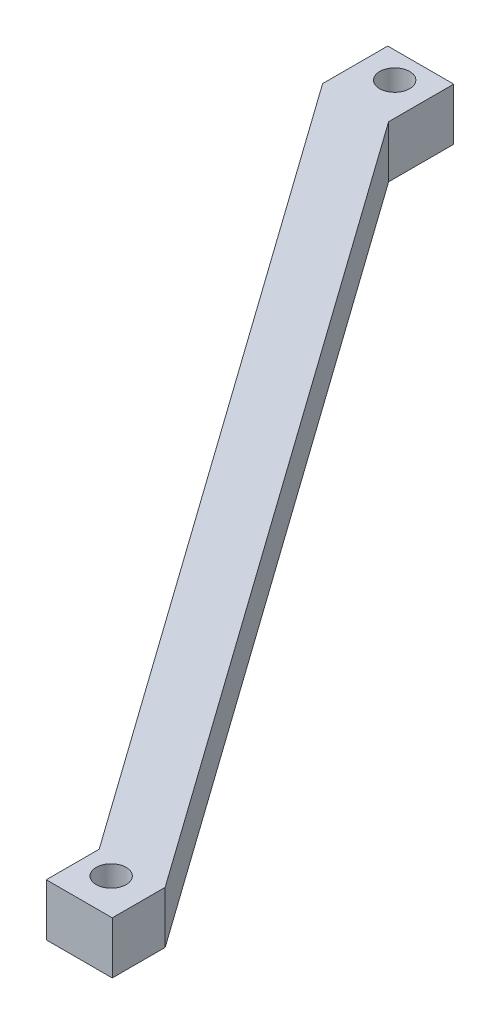
ISO-10303-21;
HEADER;
FILE_DESCRIPTION(('STEP AP214'),'2;1');
FILE_NAME('part.step','',(''),(''),'','','');
FILE_SCHEMA(('AUTOMOTIVE_DESIGN { 1 0 10303 214 1 1 1 1 }'));
ENDSEC;
DATA;
#1=APPLICATION_CONTEXT('core data for automotive mechanical design processes');
#2=APPLICATION_PROTOCOL_DEFINITION('international standard','automotive_design',2000,#1);
#3=PRODUCT_CONTEXT('',#1,'mechanical');
#4=PRODUCT('Part','Part','',(#3));
#5=PRODUCT_RELATED_PRODUCT_CATEGORY('part','',(#4));
#6=PRODUCT_DEFINITION_FORMATION('','',#4);
#7=PRODUCT_DEFINITION_CONTEXT('part definition',#1,'design');
#8=PRODUCT_DEFINITION('design','',#6,#7);
#9=PRODUCT_DEFINITION_SHAPE('','',#8);
#10=(LENGTH_UNIT() NAMED_UNIT(*) SI_UNIT(.MILLI.,.METRE.));
#11=(NAMED_UNIT(*) PLANE_ANGLE_UNIT() SI_UNIT($,.RADIAN.));
#12=(NAMED_UNIT(*) SI_UNIT($,.STERADIAN.) SOLID_ANGLE_UNIT());
#13=UNCERTAINTY_MEASURE_WITH_UNIT(LENGTH_MEASURE(1.E-05),#10,'distance_accuracy_value','');
#14=(GEOMETRIC_REPRESENTATION_CONTEXT(3) GLOBAL_UNCERTAINTY_ASSIGNED_CONTEXT((#13)) GLOBAL_UNIT_ASSIGNED_CONTEXT((#10,
#11,#12)) REPRESENTATION_CONTEXT('',''));
#15=CARTESIAN_POINT('',(0.,0.,0.));
#16=DIRECTION('',(0.,0.,1.));
#17=DIRECTION('',(1.,0.,0.));
#18=AXIS2_PLACEMENT_3D('',#15,#16,#17);
#19=CARTESIAN_POINT('',(12.6661796259949,20.,-10.));
#20=DIRECTION('',(0.,0.,1.));
#21=DIRECTION('',(1.,0.,0.));
#22=AXIS2_PLACEMENT_3D('',#19,#20,#21);
#23=PLANE('',#22);
#24=DIRECTION('',(-1.,0.,0.));
#25=VECTOR('',#24,1.);
#26=CARTESIAN_POINT('',(12.6661796259949,0.,-10.));
#27=LINE('',#26,#25);
#28=CARTESIAN_POINT('',(12.6661796259949,0.,-10.));
#29=VERTEX_POINT('',#28);
#30=CARTESIAN_POINT('',(-12.6661796259949,0.,-10.));
#31=VERTEX_POINT('',#30);
#32=EDGE_CURVE('E142',#29,#31,#27,.T.);
#33=ORIENTED_EDGE('',*,*,#32,.T.);
#34=DIRECTION('',(0.,-1.,0.));
#35=VECTOR('',#34,1.);
#36=CARTESIAN_POINT('',(-12.6661796259949,20.,-10.));
#37=LINE('',#36,#35);
#38=CARTESIAN_POINT('',(-12.6661796259949,20.,-10.));
#39=VERTEX_POINT('',#38);
#40=EDGE_CURVE('E11',#39,#31,#37,.T.);
#41=ORIENTED_EDGE('',*,*,#40,.F.);
#42=DIRECTION('',(-1.,0.,0.));
#43=VECTOR('',#42,1.);
#44=CARTESIAN_POINT('',(12.6661796259949,20.,-10.));
#45=LINE('',#44,#43);
#46=CARTESIAN_POINT('',(12.6661796259949,20.,-10.));
#47=VERTEX_POINT('',#46);
#48=EDGE_CURVE('E165',#47,#39,#45,.T.);
#49=ORIENTED_EDGE('',*,*,#48,.F.);
#50=DIRECTION('',(0.,-1.,0.));
#51=VECTOR('',#50,1.);
#52=CARTESIAN_POINT('',(12.6661796259949,20.,-10.));
#53=LINE('',#52,#51);
#54=EDGE_CURVE('E138',#47,#29,#53,.T.);
#55=ORIENTED_EDGE('',*,*,#54,.T.);
#56=EDGE_LOOP('',(#33,#41,#49,#55));
#57=FACE_BOUND('',#56,.T.);
#58=ADVANCED_FACE('F41',(#57),#23,.F.);
#59=CARTESIAN_POINT('',(-12.6661796259949,20.,-10.));
#60=DIRECTION('',(1.,0.,0.));
#61=DIRECTION('',(0.,0.,-1.));
#62=AXIS2_PLACEMENT_3D('',#59,#60,#61);
#63=PLANE('',#62);
#64=DIRECTION('',(0.,0.,1.));
#65=VECTOR('',#64,1.);
#66=CARTESIAN_POINT('',(-12.6661796259949,0.,-10.));
#67=LINE('',#66,#65);
#68=CARTESIAN_POINT('',(-12.6661796259949,0.,15.));
#69=VERTEX_POINT('',#68);
#70=EDGE_CURVE('E146',#31,#69,#67,.T.);
#71=ORIENTED_EDGE('',*,*,#70,.T.);
#72=DIRECTION('',(0.,-1.,0.));
#73=VECTOR('',#72,1.);
#74=CARTESIAN_POINT('',(-12.6661796259949,20.,15.));
#75=LINE('',#74,#73);
#76=CARTESIAN_POINT('',(-12.6661796259949,20.,15.));
#77=VERTEX_POINT('',#76);
#78=EDGE_CURVE('E50',#77,#69,#75,.T.);
#79=ORIENTED_EDGE('',*,*,#78,.F.);
#80=DIRECTION('',(0.,0.,1.));
#81=VECTOR('',#80,1.);
#82=CARTESIAN_POINT('',(-12.6661796259949,20.,-10.));
#83=LINE('',#82,#81);
#84=EDGE_CURVE('E101',#39,#77,#83,.T.);
#85=ORIENTED_EDGE('',*,*,#84,.F.);
#86=ORIENTED_EDGE('',*,*,#40,.T.);
#87=EDGE_LOOP('',(#71,#79,#85,#86));
#88=FACE_BOUND('',#87,.T.);
#89=ADVANCED_FACE('F249',(#88),#63,.F.);
#90=CARTESIAN_POINT('',(-12.6661796259949,20.,15.));
#91=DIRECTION('',(0.814766107715458,0.,-0.579789780625877));
#92=DIRECTION('',(-0.579789780625877,0.,-0.814766107715458));
#93=AXIS2_PLACEMENT_3D('',#90,#91,#92);
#94=PLANE('',#93);
#95=DIRECTION('',(0.579789780625877,0.,0.814766107715458));
#96=VECTOR('',#95,1.);
#97=CARTESIAN_POINT('',(-12.6661796259949,0.,15.));
#98=LINE('',#97,#96);
#99=CARTESIAN_POINT('',(198.95709030245,0.,312.389629316142));
#100=VERTEX_POINT('',#99);
#101=EDGE_CURVE('E150',#69,#100,#98,.T.);
#102=ORIENTED_EDGE('',*,*,#101,.T.);
#103=DIRECTION('',(0.,-1.,0.));
#104=VECTOR('',#103,1.);
#105=CARTESIAN_POINT('',(198.95709030245,20.,312.389629316142));
#106=LINE('',#105,#104);
#107=CARTESIAN_POINT('',(198.95709030245,20.,312.389629316142));
#108=VERTEX_POINT('',#107);
#109=EDGE_CURVE('E176',#108,#100,#106,.T.);
#110=ORIENTED_EDGE('',*,*,#109,.F.);
#111=DIRECTION('',(0.579789780625877,0.,0.814766107715458));
#112=VECTOR('',#111,1.);
#113=CARTESIAN_POINT('',(-12.6661796259949,20.,15.));
#114=LINE('',#113,#112);
#115=EDGE_CURVE('E186',#77,#108,#114,.T.);
#116=ORIENTED_EDGE('',*,*,#115,.F.);
#117=ORIENTED_EDGE('',*,*,#78,.T.);
#118=EDGE_LOOP('',(#102,#110,#116,#117));
#119=FACE_BOUND('',#118,.T.);
#120=ADVANCED_FACE('F184',(#119),#94,.F.);
#121=CARTESIAN_POINT('',(198.95709030245,20.,312.389629316142));
#122=DIRECTION('',(1.,0.,0.));
#123=DIRECTION('',(0.,0.,-1.));
#124=AXIS2_PLACEMENT_3D('',#121,#122,#123);
#125=PLANE('',#124);
#126=DIRECTION('',(0.,0.,1.));
#127=VECTOR('',#126,1.);
#128=CARTESIAN_POINT('',(198.95709030245,0.,312.389629316142));
#129=LINE('',#128,#127);
#130=CARTESIAN_POINT('',(198.95709030245,0.,332.698194406269));
#131=VERTEX_POINT('',#130);
#132=EDGE_CURVE('E153',#100,#131,#129,.T.);
#133=ORIENTED_EDGE('',*,*,#132,.T.);
#134=DIRECTION('',(0.,-1.,0.));
#135=VECTOR('',#134,1.);
#136=CARTESIAN_POINT('',(198.95709030245,20.,332.698194406269));
#137=LINE('',#136,#135);
#138=CARTESIAN_POINT('',(198.95709030245,20.,332.698194406269));
#139=VERTEX_POINT('',#138);
#140=EDGE_CURVE('E172',#139,#131,#137,.T.);
#141=ORIENTED_EDGE('',*,*,#140,.F.);
#142=DIRECTION('',(0.,0.,1.));
#143=VECTOR('',#142,1.);
#144=CARTESIAN_POINT('',(198.95709030245,20.,312.389629316142));
#145=LINE('',#144,#143);
#146=EDGE_CURVE('E199',#108,#139,#145,.T.);
#147=ORIENTED_EDGE('',*,*,#146,.F.);
#148=ORIENTED_EDGE('',*,*,#109,.T.);
#149=EDGE_LOOP('',(#133,#141,#147,#148));
#150=FACE_BOUND('',#149,.T.);
#151=ADVANCED_FACE('F194',(#150),#125,.F.);
#152=CARTESIAN_POINT('',(198.95709030245,20.,332.698194406269));
#153=DIRECTION('',(0.,0.,-1.));
#154=DIRECTION('',(-1.,0.,0.));
#155=AXIS2_PLACEMENT_3D('',#152,#153,#154);
#156=PLANE('',#155);
#157=DIRECTION('',(1.,0.,0.));
#158=VECTOR('',#157,1.);
#159=CARTESIAN_POINT('',(198.95709030245,0.,332.698194406269));
#160=LINE('',#159,#158);
#161=CARTESIAN_POINT('',(224.28944955444,0.,332.698194406269));
#162=VERTEX_POINT('',#161);
#163=EDGE_CURVE('E156',#131,#162,#160,.T.);
#164=ORIENTED_EDGE('',*,*,#163,.T.);
#165=DIRECTION('',(0.,-1.,0.));
#166=VECTOR('',#165,1.);
#167=CARTESIAN_POINT('',(224.28944955444,20.,332.698194406269));
#168=LINE('',#167,#166);
#169=CARTESIAN_POINT('',(224.28944955444,20.,332.698194406269));
#170=VERTEX_POINT('',#169);
#171=EDGE_CURVE('E131',#170,#162,#168,.T.);
#172=ORIENTED_EDGE('',*,*,#171,.F.);
#173=DIRECTION('',(1.,0.,0.));
#174=VECTOR('',#173,1.);
#175=CARTESIAN_POINT('',(198.95709030245,20.,332.698194406269));
#176=LINE('',#175,#174);
#177=EDGE_CURVE('E120',#139,#170,#176,.T.);
#178=ORIENTED_EDGE('',*,*,#177,.F.);
#179=ORIENTED_EDGE('',*,*,#140,.T.);
#180=EDGE_LOOP('',(#164,#172,#178,#179));
#181=FACE_BOUND('',#180,.T.);
#182=ADVANCED_FACE('F197',(#181),#156,.F.);
#183=CARTESIAN_POINT('',(224.28944955444,20.,332.698194406269));
#184=DIRECTION('',(-1.,0.,0.));
#185=DIRECTION('',(0.,0.,1.));
#186=AXIS2_PLACEMENT_3D('',#183,#184,#185);
#187=PLANE('',#186);
#188=DIRECTION('',(0.,0.,-1.));
#189=VECTOR('',#188,1.);
#190=CARTESIAN_POINT('',(224.28944955444,0.,332.698194406269));
#191=LINE('',#190,#189);
#192=CARTESIAN_POINT('',(224.28944955444,0.,312.389629316142));
#193=VERTEX_POINT('',#192);
#194=EDGE_CURVE('E129',#162,#193,#191,.T.);
#195=ORIENTED_EDGE('',*,*,#194,.T.);
#196=DIRECTION('',(0.,-1.,0.));
#197=VECTOR('',#196,1.);
#198=CARTESIAN_POINT('',(224.28944955444,20.,312.389629316142));
#199=LINE('',#198,#197);
#200=CARTESIAN_POINT('',(224.28944955444,20.,312.389629316142));
#201=VERTEX_POINT('',#200);
#202=EDGE_CURVE('E126',#201,#193,#199,.T.);
#203=ORIENTED_EDGE('',*,*,#202,.F.);
#204=DIRECTION('',(0.,0.,-1.));
#205=VECTOR('',#204,1.);
#206=CARTESIAN_POINT('',(224.28944955444,20.,332.698194406269));
#207=LINE('',#206,#205);
#208=EDGE_CURVE('E114',#170,#201,#207,.T.);
#209=ORIENTED_EDGE('',*,*,#208,.F.);
#210=ORIENTED_EDGE('',*,*,#171,.T.);
#211=EDGE_LOOP('',(#195,#203,#209,#210));
#212=FACE_BOUND('',#211,.T.);
#213=ADVANCED_FACE('F127',(#212),#187,.F.);
#214=CARTESIAN_POINT('',(224.28944955444,20.,312.389629316142));
#215=DIRECTION('',(-0.814766107715458,0.,0.579789780625877));
#216=DIRECTION('',(0.579789780625877,0.,0.814766107715458));
#217=AXIS2_PLACEMENT_3D('',#214,#215,#216);
#218=PLANE('',#217);
#219=DIRECTION('',(-0.579789780625877,0.,-0.814766107715458));
#220=VECTOR('',#219,1.);
#221=CARTESIAN_POINT('',(224.28944955444,0.,312.389629316142));
#222=LINE('',#221,#220);
#223=CARTESIAN_POINT('',(12.6661796259949,0.,15.));
#224=VERTEX_POINT('',#223);
#225=EDGE_CURVE('E87',#193,#224,#222,.T.);
#226=ORIENTED_EDGE('',*,*,#225,.T.);
#227=DIRECTION('',(0.,-1.,0.));
#228=VECTOR('',#227,1.);
#229=CARTESIAN_POINT('',(12.6661796259949,20.,15.));
#230=LINE('',#229,#228);
#231=CARTESIAN_POINT('',(12.6661796259949,20.,15.));
#232=VERTEX_POINT('',#231);
#233=EDGE_CURVE('E132',#232,#224,#230,.T.);
#234=ORIENTED_EDGE('',*,*,#233,.F.);
#235=DIRECTION('',(-0.579789780625877,0.,-0.814766107715458));
#236=VECTOR('',#235,1.);
#237=CARTESIAN_POINT('',(224.28944955444,20.,312.389629316142));
#238=LINE('',#237,#236);
#239=EDGE_CURVE('E118',#201,#232,#238,.T.);
#240=ORIENTED_EDGE('',*,*,#239,.F.);
#241=ORIENTED_EDGE('',*,*,#202,.T.);
#242=EDGE_LOOP('',(#226,#234,#240,#241));
#243=FACE_BOUND('',#242,.T.);
#244=ADVANCED_FACE('F134',(#243),#218,.F.);
#245=CARTESIAN_POINT('',(12.6661796259949,20.,15.));
#246=DIRECTION('',(-1.,0.,0.));
#247=DIRECTION('',(0.,0.,1.));
#248=AXIS2_PLACEMENT_3D('',#245,#246,#247);
#249=PLANE('',#248);
#250=DIRECTION('',(0.,0.,-1.));
#251=VECTOR('',#250,1.);
#252=CARTESIAN_POINT('',(12.6661796259949,0.,15.));
#253=LINE('',#252,#251);
#254=EDGE_CURVE('E93',#224,#29,#253,.T.);
#255=ORIENTED_EDGE('',*,*,#254,.T.);
#256=ORIENTED_EDGE('',*,*,#54,.F.);
#257=DIRECTION('',(0.,0.,-1.));
#258=VECTOR('',#257,1.);
#259=CARTESIAN_POINT('',(12.6661796259949,20.,15.));
#260=LINE('',#259,#258);
#261=EDGE_CURVE('E58',#232,#47,#260,.T.);
#262=ORIENTED_EDGE('',*,*,#261,.F.);
#263=ORIENTED_EDGE('',*,*,#233,.T.);
#264=EDGE_LOOP('',(#255,#256,#262,#263));
#265=FACE_BOUND('',#264,.T.);
#266=ADVANCED_FACE('F236',(#265),#249,.F.);
#267=CARTESIAN_POINT('',(0.,20.,0.));
#268=DIRECTION('',(0.,1.,0.));
#269=DIRECTION('',(0.,0.,1.));
#270=AXIS2_PLACEMENT_3D('',#267,#268,#269);
#271=PLANE('',#270);
#272=CARTESIAN_POINT('',(0.,20.,0.));
#273=DIRECTION('',(0.,1.,0.));
#274=DIRECTION('',(0.,0.,1.));
#275=AXIS2_PLACEMENT_3D('',#272,#273,#274);
#276=CIRCLE('',#275,5.75);
#277=CARTESIAN_POINT('',(0.,20.,5.75));
#278=VERTEX_POINT('',#277);
#279=EDGE_CURVE('E217',#278,#278,#276,.T.);
#280=ORIENTED_EDGE('',*,*,#279,.F.);
#281=EDGE_LOOP('',(#280));
#282=FACE_BOUND('',#281,.T.);
#283=CARTESIAN_POINT('',(210.164682846788,20.,318.990291519835));
#284=DIRECTION('',(0.,1.,0.));
#285=DIRECTION('',(0.,0.,1.));
#286=AXIS2_PLACEMENT_3D('',#283,#284,#285);
#287=CIRCLE('',#286,5.75);
#288=CARTESIAN_POINT('',(210.164682846788,20.,324.740291519835));
#289=VERTEX_POINT('',#288);
#290=EDGE_CURVE('E209',#289,#289,#287,.T.);
#291=ORIENTED_EDGE('',*,*,#290,.F.);
#292=EDGE_LOOP('',(#291));
#293=FACE_BOUND('',#292,.T.);
#294=ORIENTED_EDGE('',*,*,#48,.T.);
#295=ORIENTED_EDGE('',*,*,#84,.T.);
#296=ORIENTED_EDGE('',*,*,#115,.T.);
#297=ORIENTED_EDGE('',*,*,#146,.T.);
#298=ORIENTED_EDGE('',*,*,#177,.T.);
#299=ORIENTED_EDGE('',*,*,#208,.T.);
#300=ORIENTED_EDGE('',*,*,#239,.T.);
#301=ORIENTED_EDGE('',*,*,#261,.T.);
#302=EDGE_LOOP('',(#294,#295,#296,#297,#298,#299,#300,#301));
#303=FACE_BOUND('',#302,.T.);
#304=ADVANCED_FACE('F116',(#282,#293,#303),#271,.T.);
#305=CARTESIAN_POINT('',(0.,0.,0.));
#306=DIRECTION('',(0.,1.,0.));
#307=DIRECTION('',(0.,0.,1.));
#308=AXIS2_PLACEMENT_3D('',#305,#306,#307);
#309=PLANE('',#308);
#310=CARTESIAN_POINT('',(0.,0.,0.));
#311=DIRECTION('',(0.,1.,0.));
#312=DIRECTION('',(0.,0.,1.));
#313=AXIS2_PLACEMENT_3D('',#310,#311,#312);
#314=CIRCLE('',#313,5.75);
#315=CARTESIAN_POINT('',(0.,0.,5.75));
#316=VERTEX_POINT('',#315);
#317=EDGE_CURVE('E147',#316,#316,#314,.T.);
#318=ORIENTED_EDGE('',*,*,#317,.T.);
#319=EDGE_LOOP('',(#318));
#320=FACE_BOUND('',#319,.T.);
#321=CARTESIAN_POINT('',(210.164682846788,0.,318.990291519835));
#322=DIRECTION('',(0.,1.,0.));
#323=DIRECTION('',(0.,0.,1.));
#324=AXIS2_PLACEMENT_3D('',#321,#322,#323);
#325=CIRCLE('',#324,5.75);
#326=CARTESIAN_POINT('',(210.164682846788,0.,324.740291519835));
#327=VERTEX_POINT('',#326);
#328=EDGE_CURVE('E213',#327,#327,#325,.T.);
#329=ORIENTED_EDGE('',*,*,#328,.T.);
#330=EDGE_LOOP('',(#329));
#331=FACE_BOUND('',#330,.T.);
#332=ORIENTED_EDGE('',*,*,#32,.F.);
#333=ORIENTED_EDGE('',*,*,#254,.F.);
#334=ORIENTED_EDGE('',*,*,#225,.F.);
#335=ORIENTED_EDGE('',*,*,#194,.F.);
#336=ORIENTED_EDGE('',*,*,#163,.F.);
#337=ORIENTED_EDGE('',*,*,#132,.F.);
#338=ORIENTED_EDGE('',*,*,#101,.F.);
#339=ORIENTED_EDGE('',*,*,#70,.F.);
#340=EDGE_LOOP('',(#332,#333,#334,#335,#336,#337,#338,#339));
#341=FACE_BOUND('',#340,.T.);
#342=ADVANCED_FACE('F190',(#320,#331,#341),#309,.F.);
#343=CARTESIAN_POINT('',(210.164682846788,0.,318.990291519835));
#344=DIRECTION('',(0.,1.,0.));
#345=DIRECTION('',(0.,0.,1.));
#346=AXIS2_PLACEMENT_3D('',#343,#344,#345);
#347=CYLINDRICAL_SURFACE('',#346,5.75);
#348=ORIENTED_EDGE('',*,*,#328,.F.);
#349=EDGE_LOOP('',(#348));
#350=FACE_BOUND('',#349,.T.);
#351=ORIENTED_EDGE('',*,*,#290,.T.);
#352=EDGE_LOOP('',(#351));
#353=FACE_BOUND('',#352,.T.);
#354=ADVANCED_FACE('F230',(#350,#353),#347,.F.);
#355=CARTESIAN_POINT('',(0.,0.,0.));
#356=DIRECTION('',(0.,1.,0.));
#357=DIRECTION('',(0.,0.,1.));
#358=AXIS2_PLACEMENT_3D('',#355,#356,#357);
#359=CYLINDRICAL_SURFACE('',#358,5.75);
#360=ORIENTED_EDGE('',*,*,#317,.F.);
#361=EDGE_LOOP('',(#360));
#362=FACE_BOUND('',#361,.T.);
#363=ORIENTED_EDGE('',*,*,#279,.T.);
#364=EDGE_LOOP('',(#363));
#365=FACE_BOUND('',#364,.T.);
#366=ADVANCED_FACE('F227',(#362,#365),#359,.F.);
#367=CLOSED_SHELL('',(#58,#89,#120,#151,#182,#213,#244,#266,#304,#342,#354,#366));
#368=MANIFOLD_SOLID_BREP('B2',#367);
#369=ADVANCED_BREP_SHAPE_REPRESENTATION('',(#18,#368),#14);
#370=SHAPE_DEFINITION_REPRESENTATION(#9,#369);
ENDSEC;
END-ISO-10303-21;
